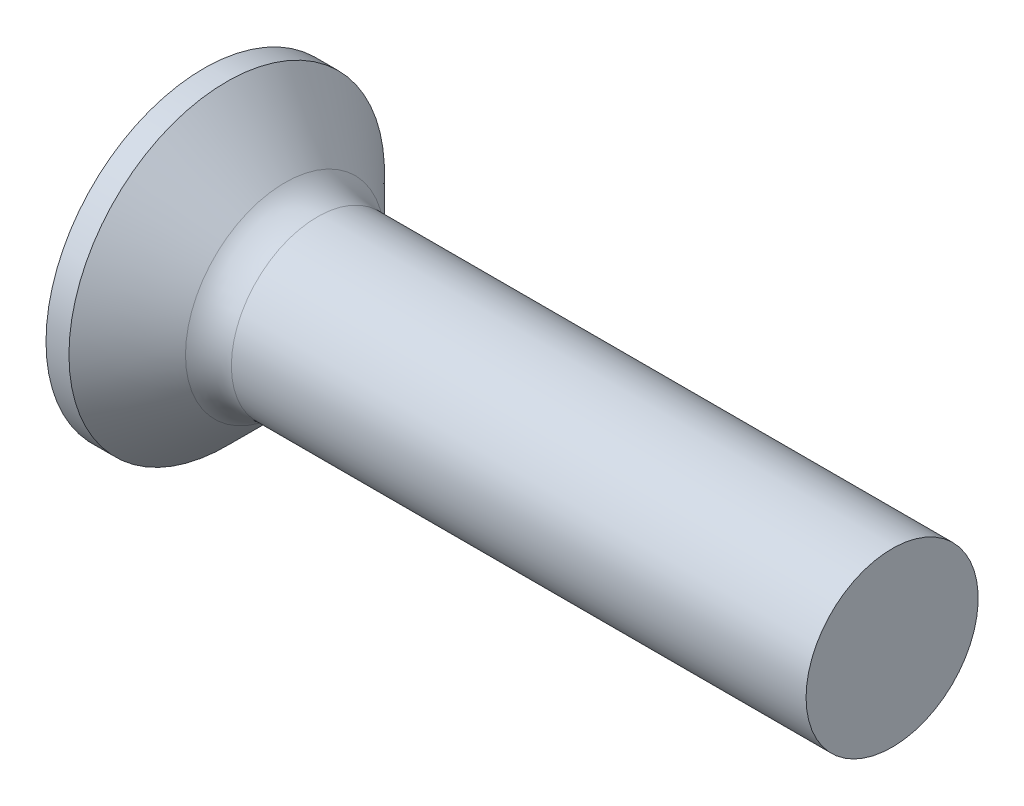
ISO-10303-21;
HEADER;
FILE_DESCRIPTION(('STEP AP214'),'2;1');
FILE_NAME('part.step','',(''),(''),'','','');
FILE_SCHEMA(('AUTOMOTIVE_DESIGN { 1 0 10303 214 1 1 1 1 }'));
ENDSEC;
DATA;
#1=APPLICATION_CONTEXT('core data for automotive mechanical design processes');
#2=APPLICATION_PROTOCOL_DEFINITION('international standard','automotive_design',2000,#1);
#3=PRODUCT_CONTEXT('',#1,'mechanical');
#4=PRODUCT('Part','Part','',(#3));
#5=PRODUCT_RELATED_PRODUCT_CATEGORY('part','',(#4));
#6=PRODUCT_DEFINITION_FORMATION('','',#4);
#7=PRODUCT_DEFINITION_CONTEXT('part definition',#1,'design');
#8=PRODUCT_DEFINITION('design','',#6,#7);
#9=PRODUCT_DEFINITION_SHAPE('','',#8);
#10=(LENGTH_UNIT() NAMED_UNIT(*) SI_UNIT(.MILLI.,.METRE.));
#11=(NAMED_UNIT(*) PLANE_ANGLE_UNIT() SI_UNIT($,.RADIAN.));
#12=(NAMED_UNIT(*) SI_UNIT($,.STERADIAN.) SOLID_ANGLE_UNIT());
#13=UNCERTAINTY_MEASURE_WITH_UNIT(LENGTH_MEASURE(1.E-05),#10,'distance_accuracy_value','');
#14=(GEOMETRIC_REPRESENTATION_CONTEXT(3) GLOBAL_UNCERTAINTY_ASSIGNED_CONTEXT((#13)) GLOBAL_UNIT_ASSIGNED_CONTEXT((#10,
#11,#12)) REPRESENTATION_CONTEXT('',''));
#15=CARTESIAN_POINT('',(0.,0.,0.));
#16=DIRECTION('',(0.,0.,1.));
#17=DIRECTION('',(1.,0.,0.));
#18=AXIS2_PLACEMENT_3D('',#15,#16,#17);
#19=CARTESIAN_POINT('',(2.01,-0.497851135403458,0.37));
#20=DIRECTION('',(0.,0.,-1.));
#21=DIRECTION('',(0.,1.,0.));
#22=AXIS2_PLACEMENT_3D('',#19,#20,#21);
#23=PLANE('',#22);
#24=DIRECTION('',(0.,-1.,0.));
#25=VECTOR('',#24,1.);
#26=CARTESIAN_POINT('',(0.,1.5,0.37));
#27=LINE('',#26,#25);
#28=CARTESIAN_POINT('',(0.,-0.590157547916263,0.37));
#29=VERTEX_POINT('',#28);
#30=CARTESIAN_POINT('',(0.,-1.5,0.37));
#31=VERTEX_POINT('',#30);
#32=EDGE_CURVE('E458',#29,#31,#27,.T.);
#33=ORIENTED_EDGE('',*,*,#32,.F.);
#34=CARTESIAN_POINT('',(-1.01053649691082,-0.672102030072118,0.37));
#35=CARTESIAN_POINT('',(-0.79970605871103,-0.655267098883947,0.37));
#36=CARTESIAN_POINT('',(-0.588886212503304,-0.638297110572311,0.37));
#37=CARTESIAN_POINT('',(-0.167272662529611,-0.603984130519828,0.37));
#38=CARTESIAN_POINT('',(0.0435210406290471,-0.586641131324258,0.37));
#39=CARTESIAN_POINT('',(0.465068838244709,-0.551479911667385,0.37));
#40=CARTESIAN_POINT('',(0.67582293271526,-0.533661691368909,0.37));
#41=CARTESIAN_POINT('',(1.09727362083221,-0.497387538872971,0.37));
#42=CARTESIAN_POINT('',(1.30797021521736,-0.478931615299089,0.37));
#43=CARTESIAN_POINT('',(1.67418894757201,-0.446067164121905,0.37));
#44=CARTESIAN_POINT('',(1.82972932585734,-0.431862501028414,0.37));
#45=CARTESIAN_POINT('',(2.14074770359484,-0.40279770973988,0.37));
#46=CARTESIAN_POINT('',(2.29622570356215,-0.38793758707517,0.37));
#47=CARTESIAN_POINT('',(2.60710169348415,-0.357305117937677,0.37));
#48=CARTESIAN_POINT('',(2.76249967840253,-0.34153271979064,0.37));
#49=CARTESIAN_POINT('',(2.99549070742189,-0.316847908281595,0.37));
#50=CARTESIAN_POINT('',(3.07313791118864,-0.308448465897182,0.37));
#51=CARTESIAN_POINT('',(3.22838341575769,-0.291202251048339,0.37));
#52=CARTESIAN_POINT('',(3.30598171599396,-0.282355473499083,0.37));
#53=CARTESIAN_POINT('',(3.38354828463398,-0.273232461289951,0.37));
#54=B_SPLINE_CURVE_WITH_KNOTS('',3,(#34,#35,#36,#37,#38,#39,#40,#41,#42,#43,#44,#45,#46,#47,#48,
#49,#50,#51,#52,#53),.UNSPECIFIED.,.F.,.F.,(4,2,2,2,2,2,2,2,2,4),(0.,0.634504777554396,
1.26902224766093,1.90353950036111,2.53804817592041,3.00661008438666,3.47516804019383,
3.94375256268972,4.17805198331267,4.41235406779909),.UNSPECIFIED.);
#55=CARTESIAN_POINT('',(2.01,-0.415013252800437,0.37));
#56=VERTEX_POINT('',#55);
#57=EDGE_CURVE('E214',#29,#56,#54,.T.);
#58=ORIENTED_EDGE('',*,*,#57,.T.);
#59=DIRECTION('',(0.,-1.,0.));
#60=VECTOR('',#59,1.);
#61=CARTESIAN_POINT('',(2.01,0.497851135403459,0.37));
#62=LINE('',#61,#60);
#63=CARTESIAN_POINT('',(2.01,-0.497851135403458,0.37));
#64=VERTEX_POINT('',#63);
#65=EDGE_CURVE('E367',#56,#64,#62,.T.);
#66=ORIENTED_EDGE('',*,*,#65,.T.);
#67=DIRECTION('',(0.894934391398442,0.446197753347436,0.));
#68=VECTOR('',#67,1.);
#69=CARTESIAN_POINT('',(0.,-1.5,0.37));
#70=LINE('',#69,#68);
#71=EDGE_CURVE('E466',#31,#64,#70,.T.);
#72=ORIENTED_EDGE('',*,*,#71,.F.);
#73=EDGE_LOOP('',(#33,#58,#66,#72));
#74=FACE_BOUND('',#73,.T.);
#75=ADVANCED_FACE('F35',(#74),#23,.T.);
#76=CARTESIAN_POINT('',(2.01,0.497851135403459,0.37));
#77=VERTEX_POINT('',#76);
#78=CARTESIAN_POINT('',(2.01,0.415013252800437,0.37));
#79=VERTEX_POINT('',#78);
#80=EDGE_CURVE('E363',#77,#79,#62,.T.);
#81=ORIENTED_EDGE('',*,*,#80,.T.);
#82=CARTESIAN_POINT('',(-1.01053649699026,0.672102030078459,0.37));
#83=CARTESIAN_POINT('',(-0.799706058781648,0.65526709888962,0.37));
#84=CARTESIAN_POINT('',(-0.588886212565099,0.63829711057731,0.37));
#85=CARTESIAN_POINT('',(-0.167272662573758,0.603984130523453,0.37));
#86=CARTESIAN_POINT('',(0.0435210405937219,0.586641131327185,0.37));
#87=CARTESIAN_POINT('',(0.465068838236453,0.551479911668094,0.37));
#88=CARTESIAN_POINT('',(0.675822932725248,0.533661691368078,0.37));
#89=CARTESIAN_POINT('',(1.09727362087867,0.497387538868943,0.37));
#90=CARTESIAN_POINT('',(1.30797021528206,0.478931615293404,0.37));
#91=CARTESIAN_POINT('',(1.67418894765493,0.446067164114376,0.37));
#92=CARTESIAN_POINT('',(1.82972932594025,0.431862501020785,0.37));
#93=CARTESIAN_POINT('',(2.14074770367772,0.402797709732015,0.37));
#94=CARTESIAN_POINT('',(2.29622570364503,0.38793758706717,0.37));
#95=CARTESIAN_POINT('',(2.60710169356699,0.357305117929346,0.37));
#96=CARTESIAN_POINT('',(2.76249967848536,0.341532719782115,0.37));
#97=CARTESIAN_POINT('',(2.99549070750468,0.316847908272698,0.37));
#98=CARTESIAN_POINT('',(3.07313791127142,0.308448465888148,0.37));
#99=CARTESIAN_POINT('',(3.22838341584044,0.291202251038989,0.37));
#100=CARTESIAN_POINT('',(3.30598171607669,0.282355473489554,0.37));
#101=CARTESIAN_POINT('',(3.38354828471668,0.273232461280215,0.37));
#102=B_SPLINE_CURVE_WITH_KNOTS('',3,(#82,#83,#84,#85,#86,#87,#88,#89,#90,#91,#92,#93,#94,#95,
#96,#97,#98,#99,#100,#101),.UNSPECIFIED.,.F.,.F.,(4,2,2,2,2,2,2,2,2,4),(0.,0.634504777580944,
1.26902224771403,1.90353950046914,2.53804817608336,3.00661008454961,3.47516804035678,
3.94375256285268,4.17805198347564,4.41235406796206),.UNSPECIFIED.);
#103=CARTESIAN_POINT('',(0.,0.590157547916263,0.37));
#104=VERTEX_POINT('',#103);
#105=EDGE_CURVE('E207',#79,#104,#102,.F.);
#106=ORIENTED_EDGE('',*,*,#105,.T.);
#107=CARTESIAN_POINT('',(0.,1.5,0.37));
#108=VERTEX_POINT('',#107);
#109=EDGE_CURVE('E460',#108,#104,#27,.T.);
#110=ORIENTED_EDGE('',*,*,#109,.F.);
#111=DIRECTION('',(0.894934391398442,-0.446197753347436,0.));
#112=VECTOR('',#111,1.);
#113=CARTESIAN_POINT('',(0.,1.5,0.37));
#114=LINE('',#113,#112);
#115=EDGE_CURVE('E58',#108,#77,#114,.T.);
#116=ORIENTED_EDGE('',*,*,#115,.T.);
#117=EDGE_LOOP('',(#81,#106,#110,#116));
#118=FACE_BOUND('',#117,.T.);
#119=ADVANCED_FACE('F189',(#118),#23,.T.);
#120=CARTESIAN_POINT('',(2.01,0.497851135403458,-0.37));
#121=DIRECTION('',(0.,0.,1.));
#122=DIRECTION('',(1.,0.,0.));
#123=AXIS2_PLACEMENT_3D('',#120,#121,#122);
#124=PLANE('',#123);
#125=DIRECTION('',(0.,1.,0.));
#126=VECTOR('',#125,1.);
#127=CARTESIAN_POINT('',(2.01,-0.497851135403459,-0.37));
#128=LINE('',#127,#126);
#129=CARTESIAN_POINT('',(2.01,-0.497851135403459,-0.37));
#130=VERTEX_POINT('',#129);
#131=CARTESIAN_POINT('',(2.01,-0.415013252800437,-0.37));
#132=VERTEX_POINT('',#131);
#133=EDGE_CURVE('E376',#130,#132,#128,.T.);
#134=ORIENTED_EDGE('',*,*,#133,.T.);
#135=CARTESIAN_POINT('',(-1.01053649699026,-0.672102030078459,-0.37));
#136=CARTESIAN_POINT('',(-0.799706058781648,-0.65526709888962,-0.37));
#137=CARTESIAN_POINT('',(-0.588886212565099,-0.63829711057731,-0.37));
#138=CARTESIAN_POINT('',(-0.167272662573759,-0.603984130523453,-0.37));
#139=CARTESIAN_POINT('',(0.0435210405937218,-0.586641131327185,-0.37));
#140=CARTESIAN_POINT('',(0.465068838236453,-0.551479911668094,-0.37));
#141=CARTESIAN_POINT('',(0.675822932725248,-0.533661691368078,-0.37));
#142=CARTESIAN_POINT('',(1.09727362087867,-0.497387538868943,-0.37));
#143=CARTESIAN_POINT('',(1.30797021528206,-0.478931615293404,-0.37));
#144=CARTESIAN_POINT('',(1.67418894765493,-0.446067164114376,-0.37));
#145=CARTESIAN_POINT('',(1.82972932594025,-0.431862501020785,-0.37));
#146=CARTESIAN_POINT('',(2.14074770367772,-0.402797709732015,-0.37));
#147=CARTESIAN_POINT('',(2.29622570364503,-0.38793758706717,-0.37));
#148=CARTESIAN_POINT('',(2.60710169356699,-0.357305117929346,-0.37));
#149=CARTESIAN_POINT('',(2.76249967848536,-0.341532719782116,-0.37));
#150=CARTESIAN_POINT('',(2.99549070750468,-0.316847908272698,-0.37));
#151=CARTESIAN_POINT('',(3.07313791127142,-0.308448465888148,-0.37));
#152=CARTESIAN_POINT('',(3.22838341584044,-0.291202251038989,-0.37));
#153=CARTESIAN_POINT('',(3.30598171607669,-0.282355473489554,-0.37));
#154=CARTESIAN_POINT('',(3.38354828471668,-0.273232461280215,-0.37));
#155=B_SPLINE_CURVE_WITH_KNOTS('',3,(#135,#136,#137,#138,#139,#140,#141,#142,#143,#144,#145,
#146,#147,#148,#149,#150,#151,#152,#153,#154),.UNSPECIFIED.,.F.,.F.,(4,2,2,2,2,2,2,2,2,4),(0.,
0.634504777580944,1.26902224771403,1.90353950046914,2.53804817608336,3.00661008454961,
3.47516804035678,3.94375256285268,4.17805198347564,4.41235406796206),.UNSPECIFIED.);
#156=CARTESIAN_POINT('',(0.,-0.590157547916263,-0.37));
#157=VERTEX_POINT('',#156);
#158=EDGE_CURVE('E270',#132,#157,#155,.F.);
#159=ORIENTED_EDGE('',*,*,#158,.T.);
#160=DIRECTION('',(0.,1.,0.));
#161=VECTOR('',#160,1.);
#162=CARTESIAN_POINT('',(0.,-1.5,-0.37));
#163=LINE('',#162,#161);
#164=CARTESIAN_POINT('',(0.,-1.5,-0.37));
#165=VERTEX_POINT('',#164);
#166=EDGE_CURVE('E459',#165,#157,#163,.T.);
#167=ORIENTED_EDGE('',*,*,#166,.F.);
#168=DIRECTION('',(0.894934391398442,0.446197753347436,0.));
#169=VECTOR('',#168,1.);
#170=CARTESIAN_POINT('',(0.,-1.5,-0.37));
#171=LINE('',#170,#169);
#172=EDGE_CURVE('E469',#165,#130,#171,.T.);
#173=ORIENTED_EDGE('',*,*,#172,.T.);
#174=EDGE_LOOP('',(#134,#159,#167,#173));
#175=FACE_BOUND('',#174,.T.);
#176=ADVANCED_FACE('F195',(#175),#124,.T.);
#177=CARTESIAN_POINT('',(0.,0.590157547916263,-0.37));
#178=VERTEX_POINT('',#177);
#179=CARTESIAN_POINT('',(0.,1.5,-0.37));
#180=VERTEX_POINT('',#179);
#181=EDGE_CURVE('E465',#178,#180,#163,.T.);
#182=ORIENTED_EDGE('',*,*,#181,.F.);
#183=CARTESIAN_POINT('',(-1.01053649699026,0.672102030078459,-0.37));
#184=CARTESIAN_POINT('',(-0.799706058781648,0.65526709888962,-0.37));
#185=CARTESIAN_POINT('',(-0.588886212565099,0.63829711057731,-0.37));
#186=CARTESIAN_POINT('',(-0.167272662573759,0.603984130523453,-0.37));
#187=CARTESIAN_POINT('',(0.0435210405937218,0.586641131327185,-0.37));
#188=CARTESIAN_POINT('',(0.465068838236453,0.551479911668094,-0.37));
#189=CARTESIAN_POINT('',(0.675822932725248,0.533661691368078,-0.37));
#190=CARTESIAN_POINT('',(1.09727362087867,0.497387538868943,-0.37));
#191=CARTESIAN_POINT('',(1.30797021528206,0.478931615293404,-0.37));
#192=CARTESIAN_POINT('',(1.67418894765493,0.446067164114376,-0.37));
#193=CARTESIAN_POINT('',(1.82972932594025,0.431862501020785,-0.37));
#194=CARTESIAN_POINT('',(2.14074770367772,0.402797709732015,-0.37));
#195=CARTESIAN_POINT('',(2.29622570364503,0.38793758706717,-0.37));
#196=CARTESIAN_POINT('',(2.60710169356699,0.357305117929346,-0.37));
#197=CARTESIAN_POINT('',(2.76249967848536,0.341532719782115,-0.37));
#198=CARTESIAN_POINT('',(2.99549070750468,0.316847908272698,-0.37));
#199=CARTESIAN_POINT('',(3.07313791127142,0.308448465888148,-0.37));
#200=CARTESIAN_POINT('',(3.22838341584044,0.291202251038989,-0.37));
#201=CARTESIAN_POINT('',(3.30598171607669,0.282355473489554,-0.37));
#202=CARTESIAN_POINT('',(3.38354828471668,0.273232461280215,-0.37));
#203=B_SPLINE_CURVE_WITH_KNOTS('',3,(#183,#184,#185,#186,#187,#188,#189,#190,#191,#192,#193,
#194,#195,#196,#197,#198,#199,#200,#201,#202),.UNSPECIFIED.,.F.,.F.,(4,2,2,2,2,2,2,2,2,4),(0.,
0.634504777580944,1.26902224771403,1.90353950046914,2.53804817608336,3.00661008454961,
3.47516804035678,3.94375256285268,4.17805198347564,4.41235406796206),.UNSPECIFIED.);
#204=CARTESIAN_POINT('',(2.01,0.415013252800437,-0.37));
#205=VERTEX_POINT('',#204);
#206=EDGE_CURVE('E264',#178,#205,#203,.T.);
#207=ORIENTED_EDGE('',*,*,#206,.T.);
#208=CARTESIAN_POINT('',(2.01,0.497851135403459,-0.37));
#209=VERTEX_POINT('',#208);
#210=EDGE_CURVE('E378',#205,#209,#128,.T.);
#211=ORIENTED_EDGE('',*,*,#210,.T.);
#212=DIRECTION('',(0.894934391398442,-0.446197753347436,0.));
#213=VECTOR('',#212,1.);
#214=CARTESIAN_POINT('',(0.,1.5,-0.37));
#215=LINE('',#214,#213);
#216=EDGE_CURVE('E375',#180,#209,#215,.T.);
#217=ORIENTED_EDGE('',*,*,#216,.F.);
#218=EDGE_LOOP('',(#182,#207,#211,#217));
#219=FACE_BOUND('',#218,.T.);
#220=ADVANCED_FACE('F476',(#219),#124,.T.);
#221=CARTESIAN_POINT('',(2.01,0.497851135403459,-0.37));
#222=DIRECTION('',(1.,0.,0.));
#223=DIRECTION('',(0.,0.,-1.));
#224=AXIS2_PLACEMENT_3D('',#221,#222,#223);
#225=PLANE('',#224);
#226=CARTESIAN_POINT('',(2.01,0.,0.));
#227=DIRECTION('',(-1.,0.,0.));
#228=DIRECTION('',(0.,0.,1.));
#229=AXIS2_PLACEMENT_3D('',#226,#227,#228);
#230=CIRCLE('',#229,0.555999999999999);
#231=CARTESIAN_POINT('',(2.01,-0.24754847399547,-0.497851135403459));
#232=VERTEX_POINT('',#231);
#233=CARTESIAN_POINT('',(2.01,-0.369999999999999,-0.415013252800438));
#234=VERTEX_POINT('',#233);
#235=EDGE_CURVE('E342',#232,#234,#230,.T.);
#236=ORIENTED_EDGE('',*,*,#235,.F.);
#237=DIRECTION('',(0.,1.,0.));
#238=VECTOR('',#237,1.);
#239=CARTESIAN_POINT('',(2.01,-0.369999999999998,-0.49785113540346));
#240=LINE('',#239,#238);
#241=CARTESIAN_POINT('',(2.01,-0.369999999999998,-0.49785113540346));
#242=VERTEX_POINT('',#241);
#243=EDGE_CURVE('E443',#242,#232,#240,.T.);
#244=ORIENTED_EDGE('',*,*,#243,.F.);
#245=DIRECTION('',(0.,0.,-1.));
#246=VECTOR('',#245,1.);
#247=CARTESIAN_POINT('',(2.01,-0.370000000000002,0.497851135403457));
#248=LINE('',#247,#246);
#249=EDGE_CURVE('E447',#234,#242,#248,.T.);
#250=ORIENTED_EDGE('',*,*,#249,.F.);
#251=EDGE_LOOP('',(#236,#244,#250));
#252=FACE_BOUND('',#251,.T.);
#253=ADVANCED_FACE('F489',(#252),#225,.F.);
#254=CARTESIAN_POINT('',(2.01,-0.497851135403459,-0.247548473995471));
#255=VERTEX_POINT('',#254);
#256=EDGE_CURVE('E337',#132,#255,#230,.T.);
#257=ORIENTED_EDGE('',*,*,#256,.F.);
#258=ORIENTED_EDGE('',*,*,#133,.F.);
#259=DIRECTION('',(0.,0.,-1.));
#260=VECTOR('',#259,1.);
#261=CARTESIAN_POINT('',(2.01,-0.497851135403458,0.37));
#262=LINE('',#261,#260);
#263=EDGE_CURVE('E366',#255,#130,#262,.T.);
#264=ORIENTED_EDGE('',*,*,#263,.F.);
#265=EDGE_LOOP('',(#257,#258,#264));
#266=FACE_BOUND('',#265,.T.);
#267=ADVANCED_FACE('F495',(#266),#225,.F.);
#268=CARTESIAN_POINT('',(2.01,-0.497851135403458,0.247548473995472));
#269=VERTEX_POINT('',#268);
#270=EDGE_CURVE('E332',#269,#56,#230,.T.);
#271=ORIENTED_EDGE('',*,*,#270,.F.);
#272=EDGE_CURVE('E369',#64,#269,#262,.T.);
#273=ORIENTED_EDGE('',*,*,#272,.F.);
#274=ORIENTED_EDGE('',*,*,#65,.F.);
#275=EDGE_LOOP('',(#271,#273,#274));
#276=FACE_BOUND('',#275,.T.);
#277=ADVANCED_FACE('F501',(#276),#225,.F.);
#278=CARTESIAN_POINT('',(2.01,-0.370000000000001,0.415013252800436));
#279=VERTEX_POINT('',#278);
#280=CARTESIAN_POINT('',(2.01,-0.247548473995473,0.497851135403458));
#281=VERTEX_POINT('',#280);
#282=EDGE_CURVE('E50',#279,#281,#230,.T.);
#283=ORIENTED_EDGE('',*,*,#282,.F.);
#284=CARTESIAN_POINT('',(2.01,-0.370000000000002,0.497851135403457));
#285=VERTEX_POINT('',#284);
#286=EDGE_CURVE('E449',#285,#279,#248,.T.);
#287=ORIENTED_EDGE('',*,*,#286,.F.);
#288=DIRECTION('',(0.,-1.,0.));
#289=VECTOR('',#288,1.);
#290=CARTESIAN_POINT('',(2.01,0.369999999999998,0.49785113540346));
#291=LINE('',#290,#289);
#292=EDGE_CURVE('E448',#281,#285,#291,.T.);
#293=ORIENTED_EDGE('',*,*,#292,.F.);
#294=EDGE_LOOP('',(#283,#287,#293));
#295=FACE_BOUND('',#294,.T.);
#296=ADVANCED_FACE('F528',(#295),#225,.F.);
#297=CARTESIAN_POINT('',(2.01,0.24754847399547,0.497851135403459));
#298=VERTEX_POINT('',#297);
#299=CARTESIAN_POINT('',(2.01,0.369999999999999,0.415013252800438));
#300=VERTEX_POINT('',#299);
#301=EDGE_CURVE('E323',#298,#300,#230,.T.);
#302=ORIENTED_EDGE('',*,*,#301,.F.);
#303=CARTESIAN_POINT('',(2.01,0.369999999999998,0.49785113540346));
#304=VERTEX_POINT('',#303);
#305=EDGE_CURVE('E444',#304,#298,#291,.T.);
#306=ORIENTED_EDGE('',*,*,#305,.F.);
#307=DIRECTION('',(0.,0.,1.));
#308=VECTOR('',#307,1.);
#309=CARTESIAN_POINT('',(2.01,0.370000000000002,-0.497851135403457));
#310=LINE('',#309,#308);
#311=EDGE_CURVE('E221',#300,#304,#310,.T.);
#312=ORIENTED_EDGE('',*,*,#311,.F.);
#313=EDGE_LOOP('',(#302,#306,#312));
#314=FACE_BOUND('',#313,.T.);
#315=ADVANCED_FACE('F485',(#314),#225,.F.);
#316=CARTESIAN_POINT('',(2.01,0.497851135403459,0.247548473995471));
#317=VERTEX_POINT('',#316);
#318=EDGE_CURVE('E330',#79,#317,#230,.T.);
#319=ORIENTED_EDGE('',*,*,#318,.F.);
#320=ORIENTED_EDGE('',*,*,#80,.F.);
#321=DIRECTION('',(0.,0.,1.));
#322=VECTOR('',#321,1.);
#323=CARTESIAN_POINT('',(2.01,0.497851135403459,-0.37));
#324=LINE('',#323,#322);
#325=EDGE_CURVE('E364',#317,#77,#324,.T.);
#326=ORIENTED_EDGE('',*,*,#325,.F.);
#327=EDGE_LOOP('',(#319,#320,#326));
#328=FACE_BOUND('',#327,.T.);
#329=ADVANCED_FACE('F362',(#328),#225,.F.);
#330=CARTESIAN_POINT('',(2.01,0.497851135403459,-0.247548473995471));
#331=VERTEX_POINT('',#330);
#332=EDGE_CURVE('E352',#331,#205,#230,.T.);
#333=ORIENTED_EDGE('',*,*,#332,.F.);
#334=EDGE_CURVE('E371',#209,#331,#324,.T.);
#335=ORIENTED_EDGE('',*,*,#334,.F.);
#336=ORIENTED_EDGE('',*,*,#210,.F.);
#337=EDGE_LOOP('',(#333,#335,#336));
#338=FACE_BOUND('',#337,.T.);
#339=ADVANCED_FACE('F478',(#338),#225,.F.);
#340=CARTESIAN_POINT('',(2.01,-0.497851135403459,-0.37));
#341=DIRECTION('',(-0.446197753347436,0.894934391398443,0.));
#342=DIRECTION('',(-0.894934391398442,-0.446197753347436,0.));
#343=AXIS2_PLACEMENT_3D('',#340,#341,#342);
#344=PLANE('',#343);
#345=ORIENTED_EDGE('',*,*,#272,.T.);
#346=CARTESIAN_POINT('',(2.86902919914418,-0.0695550475538963,0.));
#347=DIRECTION('',(-0.446197753347436,0.894934391398443,0.));
#348=DIRECTION('',(-0.894934391398443,-0.446197753347436,0.));
#349=AXIS2_PLACEMENT_3D('',#346,#347,#348);
#350=ELLIPSE('',#349,1.11145971268776,0.491029001453358);
#351=EDGE_CURVE('E282',#269,#255,#350,.F.);
#352=ORIENTED_EDGE('',*,*,#351,.T.);
#353=ORIENTED_EDGE('',*,*,#263,.T.);
#354=ORIENTED_EDGE('',*,*,#172,.F.);
#355=DIRECTION('',(0.,0.,-1.));
#356=VECTOR('',#355,1.);
#357=CARTESIAN_POINT('',(0.,-1.5,0.37));
#358=LINE('',#357,#356);
#359=EDGE_CURVE('E383',#31,#165,#358,.T.);
#360=ORIENTED_EDGE('',*,*,#359,.F.);
#361=ORIENTED_EDGE('',*,*,#71,.T.);
#362=EDGE_LOOP('',(#345,#352,#353,#354,#360,#361));
#363=FACE_BOUND('',#362,.T.);
#364=ADVANCED_FACE('F201',(#363),#344,.T.);
#365=CARTESIAN_POINT('',(2.01,0.497851135403459,0.37));
#366=DIRECTION('',(-0.446197753347436,-0.894934391398443,0.));
#367=DIRECTION('',(0.894934391398442,-0.446197753347436,0.));
#368=AXIS2_PLACEMENT_3D('',#365,#366,#367);
#369=PLANE('',#368);
#370=ORIENTED_EDGE('',*,*,#334,.T.);
#371=CARTESIAN_POINT('',(2.86902919914418,0.0695550475538964,0.));
#372=DIRECTION('',(-0.446197753347436,-0.894934391398443,0.));
#373=DIRECTION('',(-0.894934391398443,0.446197753347436,0.));
#374=AXIS2_PLACEMENT_3D('',#371,#372,#373);
#375=ELLIPSE('',#374,1.11145971268776,0.491029001453358);
#376=EDGE_CURVE('E287',#331,#317,#375,.F.);
#377=ORIENTED_EDGE('',*,*,#376,.T.);
#378=ORIENTED_EDGE('',*,*,#325,.T.);
#379=ORIENTED_EDGE('',*,*,#115,.F.);
#380=DIRECTION('',(0.,0.,1.));
#381=VECTOR('',#380,1.);
#382=CARTESIAN_POINT('',(0.,1.5,-0.37));
#383=LINE('',#382,#381);
#384=EDGE_CURVE('E455',#180,#108,#383,.T.);
#385=ORIENTED_EDGE('',*,*,#384,.F.);
#386=ORIENTED_EDGE('',*,*,#216,.T.);
#387=EDGE_LOOP('',(#370,#377,#378,#379,#385,#386));
#388=FACE_BOUND('',#387,.T.);
#389=ADVANCED_FACE('F474',(#388),#369,.T.);
#390=CARTESIAN_POINT('',(2.01,0.369999999999998,0.49785113540346));
#391=DIRECTION('',(0.,-1.,0.));
#392=DIRECTION('',(1.,0.,0.));
#393=AXIS2_PLACEMENT_3D('',#390,#391,#392);
#394=PLANE('',#393);
#395=CARTESIAN_POINT('',(2.01,0.370000000000002,-0.497851135403457));
#396=VERTEX_POINT('',#395);
#397=CARTESIAN_POINT('',(2.01,0.370000000000001,-0.415013252800436));
#398=VERTEX_POINT('',#397);
#399=EDGE_CURVE('E453',#396,#398,#310,.T.);
#400=ORIENTED_EDGE('',*,*,#399,.T.);
#401=CARTESIAN_POINT('',(-1.01053649691082,0.370000000000002,-0.672102030072117));
#402=CARTESIAN_POINT('',(-0.79970605871103,0.370000000000002,-0.655267098883946));
#403=CARTESIAN_POINT('',(-0.588886212503304,0.370000000000002,-0.63829711057231));
#404=CARTESIAN_POINT('',(-0.167272662529611,0.370000000000002,-0.603984130519827));
#405=CARTESIAN_POINT('',(0.0435210406290471,0.370000000000002,-0.586641131324257));
#406=CARTESIAN_POINT('',(0.465068838244709,0.370000000000002,-0.551479911667384));
#407=CARTESIAN_POINT('',(0.67582293271526,0.370000000000002,-0.533661691368908));
#408=CARTESIAN_POINT('',(1.09727362083221,0.370000000000002,-0.49738753887297));
#409=CARTESIAN_POINT('',(1.30797021521736,0.370000000000002,-0.478931615299088));
#410=CARTESIAN_POINT('',(1.67418894757201,0.370000000000001,-0.446067164121904));
#411=CARTESIAN_POINT('',(1.82972932585734,0.370000000000001,-0.431862501028413));
#412=CARTESIAN_POINT('',(2.14074770359484,0.370000000000001,-0.402797709739879));
#413=CARTESIAN_POINT('',(2.29622570356215,0.370000000000001,-0.387937587075169));
#414=CARTESIAN_POINT('',(2.60710169348415,0.370000000000001,-0.357305117937675));
#415=CARTESIAN_POINT('',(2.76249967840253,0.370000000000001,-0.341532719790639));
#416=CARTESIAN_POINT('',(2.99549070742189,0.370000000000001,-0.316847908281593));
#417=CARTESIAN_POINT('',(3.07313791118864,0.370000000000001,-0.308448465897181));
#418=CARTESIAN_POINT('',(3.22838341575769,0.370000000000001,-0.291202251048338));
#419=CARTESIAN_POINT('',(3.30598171599396,0.370000000000001,-0.282355473499081));
#420=CARTESIAN_POINT('',(3.38354828463398,0.370000000000001,-0.273232461289949));
#421=B_SPLINE_CURVE_WITH_KNOTS('',3,(#401,#402,#403,#404,#405,#406,#407,#408,#409,#410,#411,
#412,#413,#414,#415,#416,#417,#418,#419,#420),.UNSPECIFIED.,.F.,.F.,(4,2,2,2,2,2,2,2,2,4),(0.,
0.634504777554396,1.26902224766093,1.90353950036111,2.53804817592041,3.00661008438666,
3.47516804019383,3.94375256268972,4.17805198331267,4.41235406779909),.UNSPECIFIED.);
#422=CARTESIAN_POINT('',(0.,0.370000000000002,-0.590157547916262));
#423=VERTEX_POINT('',#422);
#424=EDGE_CURVE('E256',#398,#423,#421,.F.);
#425=ORIENTED_EDGE('',*,*,#424,.T.);
#426=DIRECTION('',(0.,0.,1.));
#427=VECTOR('',#426,1.);
#428=CARTESIAN_POINT('',(0.,0.370000000000005,-1.5));
#429=LINE('',#428,#427);
#430=CARTESIAN_POINT('',(0.,0.370000000000005,-1.5));
#431=VERTEX_POINT('',#430);
#432=EDGE_CURVE('E429',#431,#423,#429,.T.);
#433=ORIENTED_EDGE('',*,*,#432,.F.);
#434=DIRECTION('',(0.894934391398442,0.,0.446197753347436));
#435=VECTOR('',#434,1.);
#436=CARTESIAN_POINT('',(0.,0.370000000000005,-1.5));
#437=LINE('',#436,#435);
#438=EDGE_CURVE('E435',#431,#396,#437,.T.);
#439=ORIENTED_EDGE('',*,*,#438,.T.);
#440=EDGE_LOOP('',(#400,#425,#433,#439));
#441=FACE_BOUND('',#440,.T.);
#442=ADVANCED_FACE('F608',(#441),#394,.T.);
#443=CARTESIAN_POINT('',(2.01,-0.369999999999998,-0.497851135403459));
#444=DIRECTION('',(0.,1.,0.));
#445=DIRECTION('',(0.,0.,1.));
#446=AXIS2_PLACEMENT_3D('',#443,#444,#445);
#447=PLANE('',#446);
#448=DIRECTION('',(0.,0.,-1.));
#449=VECTOR('',#448,1.);
#450=CARTESIAN_POINT('',(0.,-0.370000000000005,1.5));
#451=LINE('',#450,#449);
#452=CARTESIAN_POINT('',(0.,-0.369999999999998,-0.590157547916264));
#453=VERTEX_POINT('',#452);
#454=CARTESIAN_POINT('',(0.,-0.369999999999995,-1.5));
#455=VERTEX_POINT('',#454);
#456=EDGE_CURVE('E425',#453,#455,#451,.T.);
#457=ORIENTED_EDGE('',*,*,#456,.F.);
#458=CARTESIAN_POINT('',(-1.01053649699026,-0.369999999999998,-0.67210203007846));
#459=CARTESIAN_POINT('',(-0.799706058781648,-0.369999999999998,-0.655267098889621));
#460=CARTESIAN_POINT('',(-0.588886212565099,-0.369999999999998,-0.638297110577311));
#461=CARTESIAN_POINT('',(-0.167272662573759,-0.369999999999998,-0.603984130523454));
#462=CARTESIAN_POINT('',(0.043521040593722,-0.369999999999998,-0.586641131327186));
#463=CARTESIAN_POINT('',(0.465068838236453,-0.369999999999998,-0.551479911668095));
#464=CARTESIAN_POINT('',(0.675822932725248,-0.369999999999998,-0.53366169136808));
#465=CARTESIAN_POINT('',(1.09727362087867,-0.369999999999998,-0.497387538868944));
#466=CARTESIAN_POINT('',(1.30797021528206,-0.369999999999998,-0.478931615293405));
#467=CARTESIAN_POINT('',(1.67418894765493,-0.369999999999999,-0.446067164114377));
#468=CARTESIAN_POINT('',(1.82972932594025,-0.369999999999999,-0.431862501020786));
#469=CARTESIAN_POINT('',(2.14074770367772,-0.369999999999999,-0.402797709732017));
#470=CARTESIAN_POINT('',(2.29622570364503,-0.369999999999999,-0.387937587067171));
#471=CARTESIAN_POINT('',(2.60710169356699,-0.369999999999999,-0.357305117929348));
#472=CARTESIAN_POINT('',(2.76249967848536,-0.369999999999999,-0.341532719782116));
#473=CARTESIAN_POINT('',(2.99549070750468,-0.369999999999999,-0.316847908272699));
#474=CARTESIAN_POINT('',(3.07313791127142,-0.369999999999999,-0.308448465888149));
#475=CARTESIAN_POINT('',(3.22838341584044,-0.369999999999999,-0.29120225103899));
#476=CARTESIAN_POINT('',(3.30598171607669,-0.369999999999999,-0.282355473489555));
#477=CARTESIAN_POINT('',(3.38354828471668,-0.369999999999999,-0.273232461280217));
#478=B_SPLINE_CURVE_WITH_KNOTS('',3,(#458,#459,#460,#461,#462,#463,#464,#465,#466,#467,#468,
#469,#470,#471,#472,#473,#474,#475,#476,#477),.UNSPECIFIED.,.F.,.F.,(4,2,2,2,2,2,2,2,2,4),(0.,
0.634504777580944,1.26902224771403,1.90353950046914,2.53804817608336,3.00661008454961,
3.47516804035678,3.94375256285268,4.17805198347564,4.41235406796206),.UNSPECIFIED.);
#479=EDGE_CURVE('E249',#453,#234,#478,.T.);
#480=ORIENTED_EDGE('',*,*,#479,.T.);
#481=ORIENTED_EDGE('',*,*,#249,.T.);
#482=DIRECTION('',(0.894934391398442,0.,0.446197753347436));
#483=VECTOR('',#482,1.);
#484=CARTESIAN_POINT('',(0.,-0.369999999999995,-1.5));
#485=LINE('',#484,#483);
#486=EDGE_CURVE('E432',#455,#242,#485,.T.);
#487=ORIENTED_EDGE('',*,*,#486,.F.);
#488=EDGE_LOOP('',(#457,#480,#481,#487));
#489=FACE_BOUND('',#488,.T.);
#490=ADVANCED_FACE('F506',(#489),#447,.T.);
#491=CARTESIAN_POINT('',(2.01,0.370000000000002,-0.497851135403457));
#492=DIRECTION('',(-0.446197753347436,0.,0.894934391398443));
#493=DIRECTION('',(-0.894934391398442,0.,-0.446197753347436));
#494=AXIS2_PLACEMENT_3D('',#491,#492,#493);
#495=PLANE('',#494);
#496=ORIENTED_EDGE('',*,*,#243,.T.);
#497=CARTESIAN_POINT('',(2.86902919914418,0.,-0.0695550475538963));
#498=DIRECTION('',(-0.446197753347436,0.,0.894934391398443));
#499=DIRECTION('',(-0.894934391398443,0.,-0.446197753347436));
#500=AXIS2_PLACEMENT_3D('',#497,#498,#499);
#501=ELLIPSE('',#500,1.11145971268776,0.491029001453358);
#502=CARTESIAN_POINT('',(2.01,0.247548473995473,-0.497851135403458));
#503=VERTEX_POINT('',#502);
#504=EDGE_CURVE('E300',#232,#503,#501,.F.);
#505=ORIENTED_EDGE('',*,*,#504,.T.);
#506=EDGE_CURVE('E451',#503,#396,#240,.T.);
#507=ORIENTED_EDGE('',*,*,#506,.T.);
#508=ORIENTED_EDGE('',*,*,#438,.F.);
#509=DIRECTION('',(0.,1.,0.));
#510=VECTOR('',#509,1.);
#511=CARTESIAN_POINT('',(0.,-0.369999999999995,-1.5));
#512=LINE('',#511,#510);
#513=EDGE_CURVE('E424',#455,#431,#512,.T.);
#514=ORIENTED_EDGE('',*,*,#513,.F.);
#515=ORIENTED_EDGE('',*,*,#486,.T.);
#516=EDGE_LOOP('',(#496,#505,#507,#508,#514,#515));
#517=FACE_BOUND('',#516,.T.);
#518=ADVANCED_FACE('F226',(#517),#495,.T.);
#519=ORIENTED_EDGE('',*,*,#286,.T.);
#520=CARTESIAN_POINT('',(-1.01053649699026,-0.370000000000002,0.672102030078458));
#521=CARTESIAN_POINT('',(-0.799706058781648,-0.370000000000002,0.655267098889619));
#522=CARTESIAN_POINT('',(-0.588886212565099,-0.370000000000002,0.638297110577308));
#523=CARTESIAN_POINT('',(-0.167272662573759,-0.370000000000002,0.603984130523451));
#524=CARTESIAN_POINT('',(0.0435210405937216,-0.370000000000002,0.586641131327183));
#525=CARTESIAN_POINT('',(0.465068838236452,-0.370000000000002,0.551479911668093));
#526=CARTESIAN_POINT('',(0.675822932725248,-0.370000000000002,0.533661691368077));
#527=CARTESIAN_POINT('',(1.09727362087867,-0.370000000000002,0.497387538868942));
#528=CARTESIAN_POINT('',(1.30797021528206,-0.370000000000002,0.478931615293403));
#529=CARTESIAN_POINT('',(1.67418894765493,-0.370000000000002,0.446067164114375));
#530=CARTESIAN_POINT('',(1.82972932594025,-0.370000000000002,0.431862501020784));
#531=CARTESIAN_POINT('',(2.14074770367772,-0.370000000000001,0.402797709732014));
#532=CARTESIAN_POINT('',(2.29622570364503,-0.370000000000001,0.387937587067169));
#533=CARTESIAN_POINT('',(2.60710169356699,-0.370000000000001,0.357305117929345));
#534=CARTESIAN_POINT('',(2.76249967848536,-0.370000000000001,0.341532719782114));
#535=CARTESIAN_POINT('',(2.99549070750468,-0.370000000000001,0.316847908272697));
#536=CARTESIAN_POINT('',(3.07313791127142,-0.370000000000001,0.308448465888147));
#537=CARTESIAN_POINT('',(3.22838341584044,-0.370000000000001,0.291202251038988));
#538=CARTESIAN_POINT('',(3.30598171607669,-0.370000000000001,0.282355473489552));
#539=CARTESIAN_POINT('',(3.38354828471668,-0.370000000000001,0.273232461280214));
#540=B_SPLINE_CURVE_WITH_KNOTS('',3,(#520,#521,#522,#523,#524,#525,#526,#527,#528,#529,#530,
#531,#532,#533,#534,#535,#536,#537,#538,#539),.UNSPECIFIED.,.F.,.F.,(4,2,2,2,2,2,2,2,2,4),(0.,
0.634504777580944,1.26902224771403,1.90353950046914,2.53804817608336,3.00661008454961,
3.47516804035678,3.94375256285268,4.17805198347564,4.41235406796206),.UNSPECIFIED.);
#541=CARTESIAN_POINT('',(0.,-0.370000000000002,0.590157547916262));
#542=VERTEX_POINT('',#541);
#543=EDGE_CURVE('E241',#279,#542,#540,.F.);
#544=ORIENTED_EDGE('',*,*,#543,.T.);
#545=CARTESIAN_POINT('',(0.,-0.370000000000005,1.5));
#546=VERTEX_POINT('',#545);
#547=EDGE_CURVE('E420',#546,#542,#451,.T.);
#548=ORIENTED_EDGE('',*,*,#547,.F.);
#549=DIRECTION('',(0.894934391398442,0.,-0.446197753347436));
#550=VECTOR('',#549,1.);
#551=CARTESIAN_POINT('',(0.,-0.370000000000005,1.5));
#552=LINE('',#551,#550);
#553=EDGE_CURVE('E438',#546,#285,#552,.T.);
#554=ORIENTED_EDGE('',*,*,#553,.T.);
#555=EDGE_LOOP('',(#519,#544,#548,#554));
#556=FACE_BOUND('',#555,.T.);
#557=ADVANCED_FACE('F526',(#556),#447,.T.);
#558=CARTESIAN_POINT('',(0.,0.369999999999998,0.590157547916264));
#559=VERTEX_POINT('',#558);
#560=CARTESIAN_POINT('',(0.,0.369999999999994,1.5));
#561=VERTEX_POINT('',#560);
#562=EDGE_CURVE('E431',#559,#561,#429,.T.);
#563=ORIENTED_EDGE('',*,*,#562,.F.);
#564=CARTESIAN_POINT('',(-1.01053649699026,0.369999999999997,0.67210203007846));
#565=CARTESIAN_POINT('',(-0.799706058781648,0.369999999999997,0.655267098889622));
#566=CARTESIAN_POINT('',(-0.588886212565099,0.369999999999997,0.638297110577311));
#567=CARTESIAN_POINT('',(-0.167272662573758,0.369999999999998,0.603984130523454));
#568=CARTESIAN_POINT('',(0.0435210405937219,0.369999999999998,0.586641131327186));
#569=CARTESIAN_POINT('',(0.465068838236453,0.369999999999998,0.551479911668095));
#570=CARTESIAN_POINT('',(0.675822932725248,0.369999999999998,0.53366169136808));
#571=CARTESIAN_POINT('',(1.09727362087867,0.369999999999998,0.497387538868944));
#572=CARTESIAN_POINT('',(1.30797021528206,0.369999999999998,0.478931615293405));
#573=CARTESIAN_POINT('',(1.67418894765493,0.369999999999998,0.446067164114377));
#574=CARTESIAN_POINT('',(1.82972932594025,0.369999999999998,0.431862501020786));
#575=CARTESIAN_POINT('',(2.14074770367772,0.369999999999999,0.402797709732017));
#576=CARTESIAN_POINT('',(2.29622570364503,0.369999999999999,0.387937587067171));
#577=CARTESIAN_POINT('',(2.60710169356699,0.369999999999999,0.357305117929348));
#578=CARTESIAN_POINT('',(2.76249967848536,0.369999999999999,0.341532719782117));
#579=CARTESIAN_POINT('',(2.99549070750468,0.369999999999999,0.316847908272699));
#580=CARTESIAN_POINT('',(3.07313791127142,0.369999999999999,0.308448465888149));
#581=CARTESIAN_POINT('',(3.22838341584044,0.369999999999999,0.29120225103899));
#582=CARTESIAN_POINT('',(3.30598171607669,0.369999999999999,0.282355473489555));
#583=CARTESIAN_POINT('',(3.38354828471668,0.369999999999999,0.273232461280217));
#584=B_SPLINE_CURVE_WITH_KNOTS('',3,(#564,#565,#566,#567,#568,#569,#570,#571,#572,#573,#574,
#575,#576,#577,#578,#579,#580,#581,#582,#583),.UNSPECIFIED.,.F.,.F.,(4,2,2,2,2,2,2,2,2,4),(0.,
0.634504777580944,1.26902224771403,1.90353950046914,2.53804817608336,3.00661008454961,
3.47516804035678,3.94375256285268,4.17805198347564,4.41235406796206),.UNSPECIFIED.);
#585=EDGE_CURVE('E231',#559,#300,#584,.T.);
#586=ORIENTED_EDGE('',*,*,#585,.T.);
#587=ORIENTED_EDGE('',*,*,#311,.T.);
#588=DIRECTION('',(0.894934391398442,0.,-0.446197753347436));
#589=VECTOR('',#588,1.);
#590=CARTESIAN_POINT('',(0.,0.369999999999994,1.5));
#591=LINE('',#590,#589);
#592=EDGE_CURVE('E440',#561,#304,#591,.T.);
#593=ORIENTED_EDGE('',*,*,#592,.F.);
#594=EDGE_LOOP('',(#563,#586,#587,#593));
#595=FACE_BOUND('',#594,.T.);
#596=ADVANCED_FACE('F521',(#595),#394,.T.);
#597=CARTESIAN_POINT('',(2.01,-0.370000000000002,0.497851135403457));
#598=DIRECTION('',(-0.446197753347436,0.,-0.894934391398443));
#599=DIRECTION('',(0.894934391398442,0.,-0.446197753347436));
#600=AXIS2_PLACEMENT_3D('',#597,#598,#599);
#601=PLANE('',#600);
#602=ORIENTED_EDGE('',*,*,#305,.T.);
#603=CARTESIAN_POINT('',(2.86902919914418,0.,0.0695550475538964));
#604=DIRECTION('',(-0.446197753347436,0.,-0.894934391398443));
#605=DIRECTION('',(-0.894934391398443,0.,0.446197753347436));
#606=AXIS2_PLACEMENT_3D('',#603,#604,#605);
#607=ELLIPSE('',#606,1.11145971268776,0.491029001453358);
#608=EDGE_CURVE('E11',#298,#281,#607,.F.);
#609=ORIENTED_EDGE('',*,*,#608,.T.);
#610=ORIENTED_EDGE('',*,*,#292,.T.);
#611=ORIENTED_EDGE('',*,*,#553,.F.);
#612=DIRECTION('',(0.,-1.,0.));
#613=VECTOR('',#612,1.);
#614=CARTESIAN_POINT('',(0.,0.369999999999994,1.5));
#615=LINE('',#614,#613);
#616=EDGE_CURVE('E222',#561,#546,#615,.T.);
#617=ORIENTED_EDGE('',*,*,#616,.F.);
#618=ORIENTED_EDGE('',*,*,#592,.T.);
#619=EDGE_LOOP('',(#602,#609,#610,#611,#617,#618));
#620=FACE_BOUND('',#619,.T.);
#621=ADVANCED_FACE('F418',(#620),#601,.T.);
#622=CARTESIAN_POINT('',(0.,0.,0.));
#623=DIRECTION('',(-1.,0.,0.));
#624=DIRECTION('',(0.,0.,1.));
#625=AXIS2_PLACEMENT_3D('',#622,#623,#624);
#626=PLANE('',#625);
#627=CARTESIAN_POINT('',(0.,0.,0.));
#628=DIRECTION('',(-1.,0.,0.));
#629=DIRECTION('',(0.,0.,1.));
#630=AXIS2_PLACEMENT_3D('',#627,#628,#629);
#631=CIRCLE('',#630,2.75);
#632=CARTESIAN_POINT('',(0.,0.,2.75));
#633=VERTEX_POINT('',#632);
#634=EDGE_CURVE('E386',#633,#633,#631,.T.);
#635=ORIENTED_EDGE('',*,*,#634,.T.);
#636=EDGE_LOOP('',(#635));
#637=FACE_BOUND('',#636,.T.);
#638=ORIENTED_EDGE('',*,*,#547,.T.);
#639=CARTESIAN_POINT('',(0.,0.,0.));
#640=DIRECTION('',(-1.,0.,0.));
#641=DIRECTION('',(0.,0.,1.));
#642=AXIS2_PLACEMENT_3D('',#639,#640,#641);
#643=CIRCLE('',#642,0.696552892006441);
#644=EDGE_CURVE('E318',#29,#542,#643,.T.);
#645=ORIENTED_EDGE('',*,*,#644,.F.);
#646=ORIENTED_EDGE('',*,*,#32,.T.);
#647=ORIENTED_EDGE('',*,*,#359,.T.);
#648=ORIENTED_EDGE('',*,*,#166,.T.);
#649=EDGE_CURVE('E321',#453,#157,#643,.T.);
#650=ORIENTED_EDGE('',*,*,#649,.F.);
#651=ORIENTED_EDGE('',*,*,#456,.T.);
#652=ORIENTED_EDGE('',*,*,#513,.T.);
#653=ORIENTED_EDGE('',*,*,#432,.T.);
#654=EDGE_CURVE('E317',#178,#423,#643,.T.);
#655=ORIENTED_EDGE('',*,*,#654,.F.);
#656=ORIENTED_EDGE('',*,*,#181,.T.);
#657=ORIENTED_EDGE('',*,*,#384,.T.);
#658=ORIENTED_EDGE('',*,*,#109,.T.);
#659=EDGE_CURVE('E313',#559,#104,#643,.T.);
#660=ORIENTED_EDGE('',*,*,#659,.F.);
#661=ORIENTED_EDGE('',*,*,#562,.T.);
#662=ORIENTED_EDGE('',*,*,#616,.T.);
#663=EDGE_LOOP('',(#638,#645,#646,#647,#648,#650,#651,#652,#653,#655,#656,#657,#658,#660,#661,#662));
#664=FACE_BOUND('',#663,.T.);
#665=ADVANCED_FACE('F412',(#637,#664),#626,.T.);
#666=CARTESIAN_POINT('',(-6.34999999999999,0.,0.));
#667=DIRECTION('',(-1.,0.,0.));
#668=DIRECTION('',(0.,0.,1.));
#669=AXIS2_PLACEMENT_3D('',#666,#667,#668);
#670=CYLINDRICAL_SURFACE('',#669,2.75);
#671=CARTESIAN_POINT('',(0.400000000000005,0.,0.));
#672=DIRECTION('',(-1.,0.,0.));
#673=DIRECTION('',(0.,0.,1.));
#674=AXIS2_PLACEMENT_3D('',#671,#672,#673);
#675=CIRCLE('',#674,2.75);
#676=CARTESIAN_POINT('',(0.400000000000005,0.,2.75));
#677=VERTEX_POINT('',#676);
#678=EDGE_CURVE('E382',#677,#677,#675,.T.);
#679=ORIENTED_EDGE('',*,*,#678,.T.);
#680=EDGE_LOOP('',(#679));
#681=FACE_BOUND('',#680,.T.);
#682=ORIENTED_EDGE('',*,*,#634,.F.);
#683=EDGE_LOOP('',(#682));
#684=FACE_BOUND('',#683,.T.);
#685=ADVANCED_FACE('F406',(#681,#684),#670,.T.);
#686=CARTESIAN_POINT('',(0.400000000000005,0.,0.));
#687=DIRECTION('',(-1.,0.,0.));
#688=DIRECTION('',(0.,0.,1.));
#689=AXIS2_PLACEMENT_3D('',#686,#687,#688);
#690=CONICAL_SURFACE('',#689,2.75,0.78539816339745);
#691=CARTESIAN_POINT('',(1.41568542494924,0.,0.));
#692=DIRECTION('',(-1.,0.,0.));
#693=DIRECTION('',(0.,0.,1.));
#694=AXIS2_PLACEMENT_3D('',#691,#692,#693);
#695=CIRCLE('',#694,1.73431457505076);
#696=CARTESIAN_POINT('',(1.41568542494924,0.,1.73431457505076));
#697=VERTEX_POINT('',#696);
#698=EDGE_CURVE('E389',#697,#697,#695,.T.);
#699=ORIENTED_EDGE('',*,*,#698,.T.);
#700=EDGE_LOOP('',(#699));
#701=FACE_BOUND('',#700,.T.);
#702=ORIENTED_EDGE('',*,*,#678,.F.);
#703=EDGE_LOOP('',(#702));
#704=FACE_BOUND('',#703,.T.);
#705=ADVANCED_FACE('F403',(#701,#704),#690,.T.);
#706=CARTESIAN_POINT('',(-6.34999999999999,0.,0.));
#707=DIRECTION('',(-1.,0.,0.));
#708=DIRECTION('',(0.,0.,1.));
#709=AXIS2_PLACEMENT_3D('',#706,#707,#708);
#710=CYLINDRICAL_SURFACE('',#709,1.5);
#711=CARTESIAN_POINT('',(1.98137084989848,0.,0.));
#712=DIRECTION('',(-1.,0.,0.));
#713=DIRECTION('',(0.,0.,1.));
#714=AXIS2_PLACEMENT_3D('',#711,#712,#713);
#715=CIRCLE('',#714,1.5);
#716=CARTESIAN_POINT('',(1.98137084989848,0.,1.5));
#717=VERTEX_POINT('',#716);
#718=EDGE_CURVE('E43',#717,#717,#715,.F.);
#719=ORIENTED_EDGE('',*,*,#718,.T.);
#720=EDGE_LOOP('',(#719));
#721=FACE_BOUND('',#720,.T.);
#722=CARTESIAN_POINT('',(12.,0.,0.));
#723=DIRECTION('',(-1.,0.,0.));
#724=DIRECTION('',(0.,0.,1.));
#725=AXIS2_PLACEMENT_3D('',#722,#723,#724);
#726=CIRCLE('',#725,1.5);
#727=CARTESIAN_POINT('',(12.,0.,1.5));
#728=VERTEX_POINT('',#727);
#729=EDGE_CURVE('E379',#728,#728,#726,.T.);
#730=ORIENTED_EDGE('',*,*,#729,.T.);
#731=EDGE_LOOP('',(#730));
#732=FACE_BOUND('',#731,.T.);
#733=ADVANCED_FACE('F394',(#721,#732),#710,.T.);
#734=CARTESIAN_POINT('',(12.,1.5,0.));
#735=DIRECTION('',(1.,0.,0.));
#736=DIRECTION('',(0.,0.,-1.));
#737=AXIS2_PLACEMENT_3D('',#734,#735,#736);
#738=PLANE('',#737);
#739=ORIENTED_EDGE('',*,*,#729,.F.);
#740=EDGE_LOOP('',(#739));
#741=FACE_BOUND('',#740,.T.);
#742=ADVANCED_FACE('F400',(#741),#738,.T.);
#743=CARTESIAN_POINT('',(1.98137084989848,0.,0.));
#744=DIRECTION('',(-1.,0.,0.));
#745=DIRECTION('',(0.,0.,1.));
#746=AXIS2_PLACEMENT_3D('',#743,#744,#745);
#747=TOROIDAL_SURFACE('',#746,2.3,0.8);
#748=ORIENTED_EDGE('',*,*,#718,.F.);
#749=EDGE_LOOP('',(#748));
#750=FACE_BOUND('',#749,.T.);
#751=ORIENTED_EDGE('',*,*,#698,.F.);
#752=EDGE_LOOP('',(#751));
#753=FACE_BOUND('',#752,.T.);
#754=ADVANCED_FACE('F37',(#750,#753),#747,.F.);
#755=EDGE_CURVE('E347',#398,#503,#230,.T.);
#756=ORIENTED_EDGE('',*,*,#755,.F.);
#757=ORIENTED_EDGE('',*,*,#399,.F.);
#758=ORIENTED_EDGE('',*,*,#506,.F.);
#759=EDGE_LOOP('',(#756,#757,#758));
#760=FACE_BOUND('',#759,.T.);
#761=ADVANCED_FACE('F399',(#760),#225,.F.);
#762=CARTESIAN_POINT('',(2.01,0.,0.));
#763=DIRECTION('',(-1.,0.,0.));
#764=DIRECTION('',(0.,0.,1.));
#765=AXIS2_PLACEMENT_3D('',#762,#763,#764);
#766=CONICAL_SURFACE('',#765,0.555999999999999,0.0698131700797659);
#767=ORIENTED_EDGE('',*,*,#644,.T.);
#768=ORIENTED_EDGE('',*,*,#543,.F.);
#769=EDGE_CURVE('E331',#56,#279,#230,.T.);
#770=ORIENTED_EDGE('',*,*,#769,.F.);
#771=ORIENTED_EDGE('',*,*,#57,.F.);
#772=EDGE_LOOP('',(#767,#768,#770,#771));
#773=FACE_BOUND('',#772,.T.);
#774=ADVANCED_FACE('F186',(#773),#766,.F.);
#775=EDGE_CURVE('E326',#300,#79,#230,.T.);
#776=ORIENTED_EDGE('',*,*,#775,.F.);
#777=ORIENTED_EDGE('',*,*,#585,.F.);
#778=ORIENTED_EDGE('',*,*,#659,.T.);
#779=ORIENTED_EDGE('',*,*,#105,.F.);
#780=EDGE_LOOP('',(#776,#777,#778,#779));
#781=FACE_BOUND('',#780,.T.);
#782=ADVANCED_FACE('F493',(#781),#766,.F.);
#783=EDGE_CURVE('E339',#234,#132,#230,.T.);
#784=ORIENTED_EDGE('',*,*,#783,.F.);
#785=ORIENTED_EDGE('',*,*,#479,.F.);
#786=ORIENTED_EDGE('',*,*,#649,.T.);
#787=ORIENTED_EDGE('',*,*,#158,.F.);
#788=EDGE_LOOP('',(#784,#785,#786,#787));
#789=FACE_BOUND('',#788,.T.);
#790=ADVANCED_FACE('F509',(#789),#766,.F.);
#791=ORIENTED_EDGE('',*,*,#654,.T.);
#792=ORIENTED_EDGE('',*,*,#424,.F.);
#793=EDGE_CURVE('E349',#205,#398,#230,.T.);
#794=ORIENTED_EDGE('',*,*,#793,.F.);
#795=ORIENTED_EDGE('',*,*,#206,.F.);
#796=EDGE_LOOP('',(#791,#792,#794,#795));
#797=FACE_BOUND('',#796,.T.);
#798=ADVANCED_FACE('F511',(#797),#766,.F.);
#799=EDGE_CURVE('E354',#317,#331,#230,.T.);
#800=ORIENTED_EDGE('',*,*,#799,.F.);
#801=ORIENTED_EDGE('',*,*,#376,.F.);
#802=EDGE_LOOP('',(#800,#801));
#803=FACE_BOUND('',#802,.T.);
#804=ADVANCED_FACE('F516',(#803),#766,.F.);
#805=EDGE_CURVE('E334',#255,#269,#230,.T.);
#806=ORIENTED_EDGE('',*,*,#805,.F.);
#807=ORIENTED_EDGE('',*,*,#351,.F.);
#808=EDGE_LOOP('',(#806,#807));
#809=FACE_BOUND('',#808,.T.);
#810=ADVANCED_FACE('F690',(#809),#766,.F.);
#811=EDGE_CURVE('E344',#503,#232,#230,.T.);
#812=ORIENTED_EDGE('',*,*,#811,.F.);
#813=ORIENTED_EDGE('',*,*,#504,.F.);
#814=EDGE_LOOP('',(#812,#813));
#815=FACE_BOUND('',#814,.T.);
#816=ADVANCED_FACE('F183',(#815),#766,.F.);
#817=EDGE_CURVE('E327',#281,#298,#230,.T.);
#818=ORIENTED_EDGE('',*,*,#817,.F.);
#819=ORIENTED_EDGE('',*,*,#608,.F.);
#820=EDGE_LOOP('',(#818,#819));
#821=FACE_BOUND('',#820,.T.);
#822=ADVANCED_FACE('F178',(#821),#766,.F.);
#823=CARTESIAN_POINT('',(2.19065535110549,0.,0.));
#824=DIRECTION('',(-1.,0.,0.));
#825=DIRECTION('',(0.,0.,1.));
#826=AXIS2_PLACEMENT_3D('',#823,#824,#825);
#827=CONICAL_SURFACE('',#826,0.,1.25663706143592);
#828=ORIENTED_EDGE('',*,*,#301,.T.);
#829=ORIENTED_EDGE('',*,*,#775,.T.);
#830=ORIENTED_EDGE('',*,*,#318,.T.);
#831=ORIENTED_EDGE('',*,*,#799,.T.);
#832=ORIENTED_EDGE('',*,*,#332,.T.);
#833=ORIENTED_EDGE('',*,*,#793,.T.);
#834=ORIENTED_EDGE('',*,*,#755,.T.);
#835=ORIENTED_EDGE('',*,*,#811,.T.);
#836=ORIENTED_EDGE('',*,*,#235,.T.);
#837=ORIENTED_EDGE('',*,*,#783,.T.);
#838=ORIENTED_EDGE('',*,*,#256,.T.);
#839=ORIENTED_EDGE('',*,*,#805,.T.);
#840=ORIENTED_EDGE('',*,*,#270,.T.);
#841=ORIENTED_EDGE('',*,*,#769,.T.);
#842=ORIENTED_EDGE('',*,*,#282,.T.);
#843=ORIENTED_EDGE('',*,*,#817,.T.);
#844=EDGE_LOOP('',(#828,#829,#830,#831,#832,#833,#834,#835,#836,#837,#838,#839,#840,#841,#842,#843));
#845=FACE_BOUND('',#844,.T.);
#846=CARTESIAN_POINT('',(2.19065535110549,0.,0.));
#847=VERTEX_POINT('',#846);
#848=VERTEX_LOOP('',#847);
#849=FACE_BOUND('',#848,.T.);
#850=ADVANCED_FACE('F176',(#845,#849),#827,.F.);
#851=CLOSED_SHELL('',(#75,#119,#176,#220,#253,#267,#277,#296,#315,#329,#339,#364,#389,#442,#490,
#518,#557,#596,#621,#665,#685,#705,#733,#742,#754,#761,#774,#782,#790,#798,#804,#810,#816,#822,#850));
#852=MANIFOLD_SOLID_BREP('B2',#851);
#853=ADVANCED_BREP_SHAPE_REPRESENTATION('',(#18,#852),#14);
#854=SHAPE_DEFINITION_REPRESENTATION(#9,#853);
ENDSEC;
END-ISO-10303-21;
